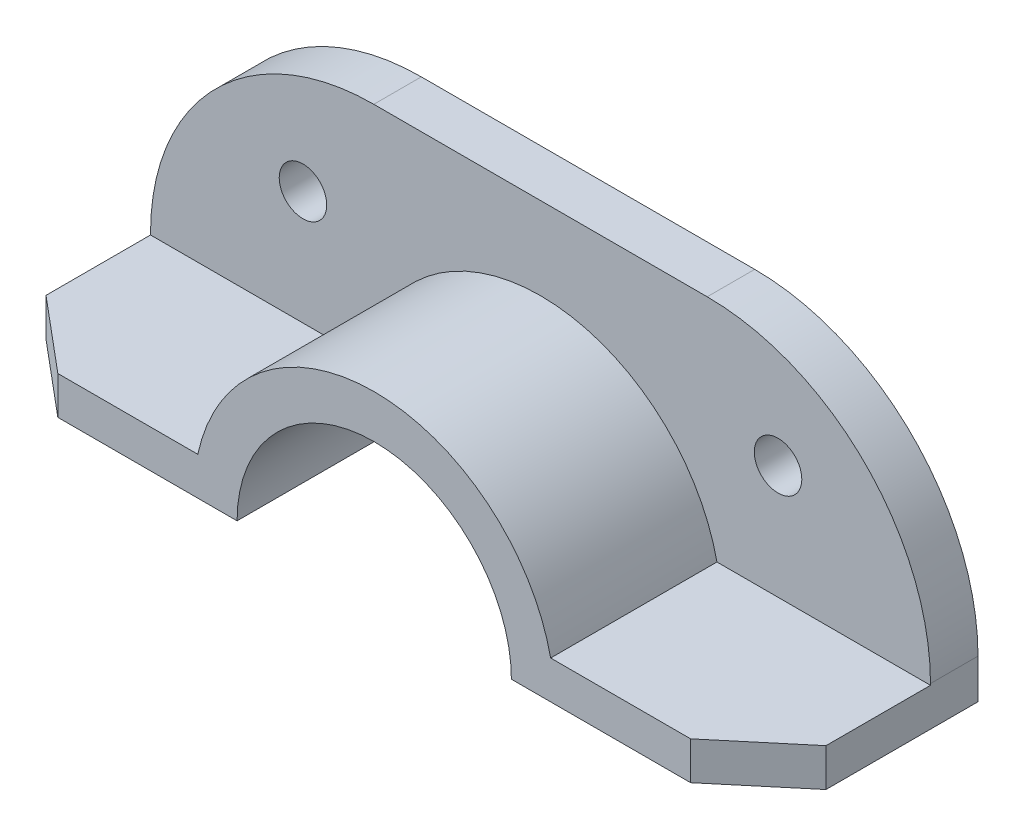
ISO-10303-21;
HEADER;
FILE_DESCRIPTION(('STEP AP214'),'2;1');
FILE_NAME('part.step','',(''),(''),'','','');
FILE_SCHEMA(('AUTOMOTIVE_DESIGN { 1 0 10303 214 1 1 1 1 }'));
ENDSEC;
DATA;
#1=APPLICATION_CONTEXT('core data for automotive mechanical design processes');
#2=APPLICATION_PROTOCOL_DEFINITION('international standard','automotive_design',2000,#1);
#3=PRODUCT_CONTEXT('',#1,'mechanical');
#4=PRODUCT('Part','Part','',(#3));
#5=PRODUCT_RELATED_PRODUCT_CATEGORY('part','',(#4));
#6=PRODUCT_DEFINITION_FORMATION('','',#4);
#7=PRODUCT_DEFINITION_CONTEXT('part definition',#1,'design');
#8=PRODUCT_DEFINITION('design','',#6,#7);
#9=PRODUCT_DEFINITION_SHAPE('','',#8);
#10=(LENGTH_UNIT() NAMED_UNIT(*) SI_UNIT(.MILLI.,.METRE.));
#11=(NAMED_UNIT(*) PLANE_ANGLE_UNIT() SI_UNIT($,.RADIAN.));
#12=(NAMED_UNIT(*) SI_UNIT($,.STERADIAN.) SOLID_ANGLE_UNIT());
#13=UNCERTAINTY_MEASURE_WITH_UNIT(LENGTH_MEASURE(1.E-05),#10,'distance_accuracy_value','');
#14=(GEOMETRIC_REPRESENTATION_CONTEXT(3) GLOBAL_UNCERTAINTY_ASSIGNED_CONTEXT((#13)) GLOBAL_UNIT_ASSIGNED_CONTEXT((#10,
#11,#12)) REPRESENTATION_CONTEXT('',''));
#15=CARTESIAN_POINT('',(0.,0.,0.));
#16=DIRECTION('',(0.,0.,1.));
#17=DIRECTION('',(1.,0.,0.));
#18=AXIS2_PLACEMENT_3D('',#15,#16,#17);
#19=CARTESIAN_POINT('',(-82.0881817576966,8.,20.));
#20=DIRECTION('',(0.,1.,0.));
#21=DIRECTION('',(-1.,0.,0.));
#22=AXIS2_PLACEMENT_3D('',#19,#20,#21);
#23=PLANE('',#22);
#24=DIRECTION('',(0.,0.,-1.));
#25=VECTOR('',#24,1.);
#26=CARTESIAN_POINT('',(-82.0881817576966,8.,20.));
#27=LINE('',#26,#25);
#28=CARTESIAN_POINT('',(-82.0881817576966,8.,7.));
#29=VERTEX_POINT('',#28);
#30=CARTESIAN_POINT('',(-82.0881817576966,8.,-15.));
#31=VERTEX_POINT('',#30);
#32=EDGE_CURVE('E152',#29,#31,#27,.T.);
#33=ORIENTED_EDGE('',*,*,#32,.F.);
#34=DIRECTION('',(0.766044443118982,0.,0.642787609686535));
#35=VECTOR('',#34,1.);
#36=CARTESIAN_POINT('',(-66.5953850539717,8.,20.));
#37=LINE('',#36,#35);
#38=CARTESIAN_POINT('',(-66.5953850539717,8.,20.));
#39=VERTEX_POINT('',#38);
#40=EDGE_CURVE('E140',#29,#39,#37,.T.);
#41=ORIENTED_EDGE('',*,*,#40,.T.);
#42=DIRECTION('',(1.,0.,0.));
#43=VECTOR('',#42,1.);
#44=CARTESIAN_POINT('',(-82.0881817576966,8.,20.));
#45=LINE('',#44,#43);
#46=CARTESIAN_POINT('',(-37.1346503952674,7.99999999999999,20.));
#47=VERTEX_POINT('',#46);
#48=EDGE_CURVE('E149',#39,#47,#45,.T.);
#49=ORIENTED_EDGE('',*,*,#48,.T.);
#50=DIRECTION('',(0.,0.,-1.));
#51=VECTOR('',#50,1.);
#52=CARTESIAN_POINT('',(-37.1346503952674,7.99999999999999,20.));
#53=LINE('',#52,#51);
#54=CARTESIAN_POINT('',(-37.1346503952674,7.99999999999999,-15.));
#55=VERTEX_POINT('',#54);
#56=EDGE_CURVE('E172',#47,#55,#53,.T.);
#57=ORIENTED_EDGE('',*,*,#56,.T.);
#58=DIRECTION('',(-1.,0.,0.));
#59=VECTOR('',#58,1.);
#60=CARTESIAN_POINT('',(-82.0881817576966,8.,-15.));
#61=LINE('',#60,#59);
#62=EDGE_CURVE('E159',#55,#31,#61,.T.);
#63=ORIENTED_EDGE('',*,*,#62,.T.);
#64=EDGE_LOOP('',(#33,#41,#49,#57,#63));
#65=FACE_BOUND('',#64,.T.);
#66=ADVANCED_FACE('F37',(#65),#23,.T.);
#67=CARTESIAN_POINT('',(0.,0.,20.));
#68=DIRECTION('',(0.,0.,1.));
#69=DIRECTION('',(1.,0.,0.));
#70=AXIS2_PLACEMENT_3D('',#67,#68,#69);
#71=PLANE('',#70);
#72=ORIENTED_EDGE('',*,*,#48,.F.);
#73=DIRECTION('',(0.,1.,0.));
#74=VECTOR('',#73,1.);
#75=CARTESIAN_POINT('',(-66.5953850539717,-2.,20.));
#76=LINE('',#75,#74);
#77=CARTESIAN_POINT('',(-66.5953850539717,0.,20.));
#78=VERTEX_POINT('',#77);
#79=EDGE_CURVE('E137',#78,#39,#76,.T.);
#80=ORIENTED_EDGE('',*,*,#79,.F.);
#81=DIRECTION('',(-1.,0.,0.));
#82=VECTOR('',#81,1.);
#83=CARTESIAN_POINT('',(-28.8690728974509,0.,20.));
#84=LINE('',#83,#82);
#85=CARTESIAN_POINT('',(-28.8690728974509,0.,20.));
#86=VERTEX_POINT('',#85);
#87=EDGE_CURVE('E158',#86,#78,#84,.T.);
#88=ORIENTED_EDGE('',*,*,#87,.F.);
#89=CARTESIAN_POINT('',(0.,0.,20.));
#90=DIRECTION('',(0.,0.,-1.));
#91=DIRECTION('',(1.,0.,0.));
#92=AXIS2_PLACEMENT_3D('',#89,#90,#91);
#93=CIRCLE('',#92,28.8690728974509);
#94=CARTESIAN_POINT('',(28.8690728974509,0.,20.));
#95=VERTEX_POINT('',#94);
#96=EDGE_CURVE('E207',#86,#95,#93,.T.);
#97=ORIENTED_EDGE('',*,*,#96,.T.);
#98=DIRECTION('',(1.,0.,0.));
#99=VECTOR('',#98,1.);
#100=CARTESIAN_POINT('',(28.8690728974509,0.,20.));
#101=LINE('',#100,#99);
#102=CARTESIAN_POINT('',(66.5953850539717,0.,20.));
#103=VERTEX_POINT('',#102);
#104=EDGE_CURVE('E210',#95,#103,#101,.T.);
#105=ORIENTED_EDGE('',*,*,#104,.T.);
#106=DIRECTION('',(0.,-1.,0.));
#107=VECTOR('',#106,1.);
#108=CARTESIAN_POINT('',(66.5953850539717,0.,20.));
#109=LINE('',#108,#107);
#110=CARTESIAN_POINT('',(66.5953850539717,8.,20.));
#111=VERTEX_POINT('',#110);
#112=EDGE_CURVE('E236',#111,#103,#109,.T.);
#113=ORIENTED_EDGE('',*,*,#112,.F.);
#114=DIRECTION('',(-1.,0.,0.));
#115=VECTOR('',#114,1.);
#116=CARTESIAN_POINT('',(82.0881817576966,8.,20.));
#117=LINE('',#116,#115);
#118=CARTESIAN_POINT('',(37.1346503952674,7.99999999999999,20.));
#119=VERTEX_POINT('',#118);
#120=EDGE_CURVE('E213',#111,#119,#117,.T.);
#121=ORIENTED_EDGE('',*,*,#120,.T.);
#122=CARTESIAN_POINT('',(0.,0.,20.));
#123=DIRECTION('',(0.,0.,1.));
#124=DIRECTION('',(1.,0.,0.));
#125=AXIS2_PLACEMENT_3D('',#122,#123,#124);
#126=CIRCLE('',#125,37.9866063235285);
#127=EDGE_CURVE('E156',#119,#47,#126,.T.);
#128=ORIENTED_EDGE('',*,*,#127,.T.);
#129=EDGE_LOOP('',(#72,#80,#88,#97,#105,#113,#121,#128));
#130=FACE_BOUND('',#129,.T.);
#131=ADVANCED_FACE('F154',(#130),#71,.T.);
#132=CARTESIAN_POINT('',(-82.0881817576966,0.,20.));
#133=DIRECTION('',(-1.,0.,0.));
#134=DIRECTION('',(0.,0.,1.));
#135=AXIS2_PLACEMENT_3D('',#132,#133,#134);
#136=PLANE('',#135);
#137=DIRECTION('',(0.,0.,-1.));
#138=VECTOR('',#137,1.);
#139=CARTESIAN_POINT('',(-82.0881817576966,0.,20.));
#140=LINE('',#139,#138);
#141=CARTESIAN_POINT('',(-82.0881817576966,0.,6.99999999999999));
#142=VERTEX_POINT('',#141);
#143=CARTESIAN_POINT('',(-82.0881817576966,0.,-25.));
#144=VERTEX_POINT('',#143);
#145=EDGE_CURVE('E169',#142,#144,#140,.T.);
#146=ORIENTED_EDGE('',*,*,#145,.F.);
#147=DIRECTION('',(0.,1.,0.));
#148=VECTOR('',#147,1.);
#149=CARTESIAN_POINT('',(-82.0881817576966,-2.,7.));
#150=LINE('',#149,#148);
#151=EDGE_CURVE('E52',#142,#29,#150,.T.);
#152=ORIENTED_EDGE('',*,*,#151,.T.);
#153=ORIENTED_EDGE('',*,*,#32,.T.);
#154=DIRECTION('',(0.,-1.,0.));
#155=VECTOR('',#154,1.);
#156=CARTESIAN_POINT('',(-82.0881817576966,0.,-15.));
#157=LINE('',#156,#155);
#158=CARTESIAN_POINT('',(-82.0881817576966,8.32638444481943,-15.));
#159=VERTEX_POINT('',#158);
#160=EDGE_CURVE('E259',#159,#31,#157,.T.);
#161=ORIENTED_EDGE('',*,*,#160,.F.);
#162=DIRECTION('',(0.,0.,1.));
#163=VECTOR('',#162,1.);
#164=CARTESIAN_POINT('',(-82.0881817576966,8.32638444481944,-25.));
#165=LINE('',#164,#163);
#166=CARTESIAN_POINT('',(-82.0881817576966,8.32638444481943,-25.));
#167=VERTEX_POINT('',#166);
#168=EDGE_CURVE('E59',#159,#167,#165,.F.);
#169=ORIENTED_EDGE('',*,*,#168,.T.);
#170=DIRECTION('',(0.,-1.,0.));
#171=VECTOR('',#170,1.);
#172=CARTESIAN_POINT('',(-82.0881817576966,0.,-25.));
#173=LINE('',#172,#171);
#174=EDGE_CURVE('E163',#167,#144,#173,.T.);
#175=ORIENTED_EDGE('',*,*,#174,.T.);
#176=EDGE_LOOP('',(#146,#152,#153,#161,#169,#175));
#177=FACE_BOUND('',#176,.T.);
#178=ADVANCED_FACE('F261',(#177),#136,.T.);
#179=CARTESIAN_POINT('',(-28.8690728974509,0.,20.));
#180=DIRECTION('',(0.,-1.,0.));
#181=DIRECTION('',(0.,0.,-1.));
#182=AXIS2_PLACEMENT_3D('',#179,#180,#181);
#183=PLANE('',#182);
#184=ORIENTED_EDGE('',*,*,#87,.T.);
#185=DIRECTION('',(-0.766044443118982,0.,-0.642787609686535));
#186=VECTOR('',#185,1.);
#187=CARTESIAN_POINT('',(-44.4566762976743,0.,38.5765823521501));
#188=LINE('',#187,#186);
#189=EDGE_CURVE('E11',#78,#142,#188,.T.);
#190=ORIENTED_EDGE('',*,*,#189,.T.);
#191=ORIENTED_EDGE('',*,*,#145,.T.);
#192=DIRECTION('',(1.,0.,0.));
#193=VECTOR('',#192,1.);
#194=CARTESIAN_POINT('',(-28.8690728974509,0.,-25.));
#195=LINE('',#194,#193);
#196=CARTESIAN_POINT('',(-28.8690728974509,0.,-25.));
#197=VERTEX_POINT('',#196);
#198=EDGE_CURVE('E262',#144,#197,#195,.T.);
#199=ORIENTED_EDGE('',*,*,#198,.T.);
#200=DIRECTION('',(0.,0.,-1.));
#201=VECTOR('',#200,1.);
#202=CARTESIAN_POINT('',(-28.8690728974509,0.,20.));
#203=LINE('',#202,#201);
#204=EDGE_CURVE('E161',#86,#197,#203,.T.);
#205=ORIENTED_EDGE('',*,*,#204,.F.);
#206=EDGE_LOOP('',(#184,#190,#191,#199,#205));
#207=FACE_BOUND('',#206,.T.);
#208=ADVANCED_FACE('F274',(#207),#183,.T.);
#209=CARTESIAN_POINT('',(0.,0.,20.));
#210=DIRECTION('',(0.,0.,-1.));
#211=DIRECTION('',(-1.,0.,0.));
#212=AXIS2_PLACEMENT_3D('',#209,#210,#211);
#213=CYLINDRICAL_SURFACE('',#212,37.9866063235285);
#214=CARTESIAN_POINT('',(0.,0.,-15.));
#215=DIRECTION('',(0.,0.,-1.));
#216=DIRECTION('',(-1.,0.,0.));
#217=AXIS2_PLACEMENT_3D('',#214,#215,#216);
#218=CIRCLE('',#217,37.9866063235285);
#219=CARTESIAN_POINT('',(37.1346503952674,7.99999999999999,-15.));
#220=VERTEX_POINT('',#219);
#221=EDGE_CURVE('E199',#55,#220,#218,.T.);
#222=ORIENTED_EDGE('',*,*,#221,.F.);
#223=ORIENTED_EDGE('',*,*,#56,.F.);
#224=ORIENTED_EDGE('',*,*,#127,.F.);
#225=DIRECTION('',(0.,0.,-1.));
#226=VECTOR('',#225,1.);
#227=CARTESIAN_POINT('',(37.1346503952674,7.99999999999999,20.));
#228=LINE('',#227,#226);
#229=EDGE_CURVE('E216',#119,#220,#228,.T.);
#230=ORIENTED_EDGE('',*,*,#229,.T.);
#231=EDGE_LOOP('',(#222,#223,#224,#230));
#232=FACE_BOUND('',#231,.T.);
#233=ADVANCED_FACE('F303',(#232),#213,.T.);
#234=CARTESIAN_POINT('',(82.0881817576966,8.,20.));
#235=DIRECTION('',(0.,-1.,0.));
#236=DIRECTION('',(1.,0.,0.));
#237=AXIS2_PLACEMENT_3D('',#234,#235,#236);
#238=PLANE('',#237);
#239=ORIENTED_EDGE('',*,*,#120,.F.);
#240=DIRECTION('',(-0.766044443118982,0.,0.642787609686535));
#241=VECTOR('',#240,1.);
#242=CARTESIAN_POINT('',(66.5953850539717,8.,20.));
#243=LINE('',#242,#241);
#244=CARTESIAN_POINT('',(82.0881817576966,8.,7.));
#245=VERTEX_POINT('',#244);
#246=EDGE_CURVE('E174',#245,#111,#243,.T.);
#247=ORIENTED_EDGE('',*,*,#246,.F.);
#248=DIRECTION('',(0.,0.,-1.));
#249=VECTOR('',#248,1.);
#250=CARTESIAN_POINT('',(82.0881817576966,8.,20.));
#251=LINE('',#250,#249);
#252=CARTESIAN_POINT('',(82.0881817576966,7.99999999999999,-15.));
#253=VERTEX_POINT('',#252);
#254=EDGE_CURVE('E219',#245,#253,#251,.T.);
#255=ORIENTED_EDGE('',*,*,#254,.T.);
#256=DIRECTION('',(1.,0.,0.));
#257=VECTOR('',#256,1.);
#258=CARTESIAN_POINT('',(82.0881817576966,8.,-15.));
#259=LINE('',#258,#257);
#260=EDGE_CURVE('E204',#220,#253,#259,.T.);
#261=ORIENTED_EDGE('',*,*,#260,.F.);
#262=ORIENTED_EDGE('',*,*,#229,.F.);
#263=EDGE_LOOP('',(#239,#247,#255,#261,#262));
#264=FACE_BOUND('',#263,.T.);
#265=ADVANCED_FACE('F298',(#264),#238,.F.);
#266=CARTESIAN_POINT('',(0.,0.,20.));
#267=DIRECTION('',(0.,0.,-1.));
#268=DIRECTION('',(-1.,0.,0.));
#269=AXIS2_PLACEMENT_3D('',#266,#267,#268);
#270=CYLINDRICAL_SURFACE('',#269,28.8690728974509);
#271=ORIENTED_EDGE('',*,*,#204,.T.);
#272=CARTESIAN_POINT('',(0.,0.,-25.));
#273=DIRECTION('',(0.,0.,1.));
#274=DIRECTION('',(-1.,0.,0.));
#275=AXIS2_PLACEMENT_3D('',#272,#273,#274);
#276=CIRCLE('',#275,28.8690728974509);
#277=CARTESIAN_POINT('',(28.8690728974509,0.,-25.));
#278=VERTEX_POINT('',#277);
#279=EDGE_CURVE('E188',#278,#197,#276,.T.);
#280=ORIENTED_EDGE('',*,*,#279,.F.);
#281=DIRECTION('',(0.,0.,-1.));
#282=VECTOR('',#281,1.);
#283=CARTESIAN_POINT('',(28.8690728974509,0.,20.));
#284=LINE('',#283,#282);
#285=EDGE_CURVE('E223',#95,#278,#284,.T.);
#286=ORIENTED_EDGE('',*,*,#285,.F.);
#287=ORIENTED_EDGE('',*,*,#96,.F.);
#288=EDGE_LOOP('',(#271,#280,#286,#287));
#289=FACE_BOUND('',#288,.T.);
#290=ADVANCED_FACE('F280',(#289),#270,.F.);
#291=CARTESIAN_POINT('',(28.8690728974509,0.,20.));
#292=DIRECTION('',(0.,1.,0.));
#293=DIRECTION('',(0.,0.,1.));
#294=AXIS2_PLACEMENT_3D('',#291,#292,#293);
#295=PLANE('',#294);
#296=DIRECTION('',(0.,0.,-1.));
#297=VECTOR('',#296,1.);
#298=CARTESIAN_POINT('',(82.0881817576966,0.,20.));
#299=LINE('',#298,#297);
#300=CARTESIAN_POINT('',(82.0881817576966,0.,7.));
#301=VERTEX_POINT('',#300);
#302=CARTESIAN_POINT('',(82.0881817576966,0.,-25.));
#303=VERTEX_POINT('',#302);
#304=EDGE_CURVE('E221',#301,#303,#299,.T.);
#305=ORIENTED_EDGE('',*,*,#304,.F.);
#306=DIRECTION('',(-0.766044443118982,0.,0.642787609686535));
#307=VECTOR('',#306,1.);
#308=CARTESIAN_POINT('',(44.4566762976743,0.,38.5765823521501));
#309=LINE('',#308,#307);
#310=EDGE_CURVE('E178',#301,#103,#309,.T.);
#311=ORIENTED_EDGE('',*,*,#310,.T.);
#312=ORIENTED_EDGE('',*,*,#104,.F.);
#313=ORIENTED_EDGE('',*,*,#285,.T.);
#314=DIRECTION('',(-1.,0.,0.));
#315=VECTOR('',#314,1.);
#316=CARTESIAN_POINT('',(28.8690728974509,0.,-25.));
#317=LINE('',#316,#315);
#318=EDGE_CURVE('E196',#303,#278,#317,.T.);
#319=ORIENTED_EDGE('',*,*,#318,.F.);
#320=EDGE_LOOP('',(#305,#311,#312,#313,#319));
#321=FACE_BOUND('',#320,.T.);
#322=ADVANCED_FACE('F284',(#321),#295,.F.);
#323=CARTESIAN_POINT('',(82.0881817576966,0.,20.));
#324=DIRECTION('',(-1.,0.,0.));
#325=DIRECTION('',(0.,0.,1.));
#326=AXIS2_PLACEMENT_3D('',#323,#324,#325);
#327=PLANE('',#326);
#328=ORIENTED_EDGE('',*,*,#254,.F.);
#329=DIRECTION('',(0.,1.,0.));
#330=VECTOR('',#329,1.);
#331=CARTESIAN_POINT('',(82.0881817576966,-2.,7.));
#332=LINE('',#331,#330);
#333=EDGE_CURVE('E176',#301,#245,#332,.T.);
#334=ORIENTED_EDGE('',*,*,#333,.F.);
#335=ORIENTED_EDGE('',*,*,#304,.T.);
#336=DIRECTION('',(0.,-1.,0.));
#337=VECTOR('',#336,1.);
#338=CARTESIAN_POINT('',(82.0881817576966,0.,-25.));
#339=LINE('',#338,#337);
#340=CARTESIAN_POINT('',(82.0881817576966,8.32638444481943,-25.));
#341=VERTEX_POINT('',#340);
#342=EDGE_CURVE('E193',#341,#303,#339,.T.);
#343=ORIENTED_EDGE('',*,*,#342,.F.);
#344=DIRECTION('',(0.,0.,1.));
#345=VECTOR('',#344,1.);
#346=CARTESIAN_POINT('',(82.0881817576966,8.32638444481944,20.));
#347=LINE('',#346,#345);
#348=CARTESIAN_POINT('',(82.0881817576966,8.32638444481943,-15.));
#349=VERTEX_POINT('',#348);
#350=EDGE_CURVE('E225',#341,#349,#347,.T.);
#351=ORIENTED_EDGE('',*,*,#350,.T.);
#352=DIRECTION('',(0.,-1.,0.));
#353=VECTOR('',#352,1.);
#354=CARTESIAN_POINT('',(82.0881817576966,0.,-15.));
#355=LINE('',#354,#353);
#356=EDGE_CURVE('E191',#349,#253,#355,.T.);
#357=ORIENTED_EDGE('',*,*,#356,.T.);
#358=EDGE_LOOP('',(#328,#334,#335,#343,#351,#357));
#359=FACE_BOUND('',#358,.T.);
#360=ADVANCED_FACE('F289',(#359),#327,.F.);
#361=CARTESIAN_POINT('',(0.,0.,-15.));
#362=DIRECTION('',(0.,0.,-1.));
#363=DIRECTION('',(-1.,0.,0.));
#364=AXIS2_PLACEMENT_3D('',#361,#362,#363);
#365=PLANE('',#364);
#366=CARTESIAN_POINT('',(-50.,32.,-15.));
#367=DIRECTION('',(0.,0.,-1.));
#368=DIRECTION('',(-1.,0.,0.));
#369=AXIS2_PLACEMENT_3D('',#366,#367,#368);
#370=CIRCLE('',#369,5.);
#371=CARTESIAN_POINT('',(-55.,32.,-15.));
#372=VERTEX_POINT('',#371);
#373=EDGE_CURVE('E267',#372,#372,#370,.T.);
#374=ORIENTED_EDGE('',*,*,#373,.T.);
#375=EDGE_LOOP('',(#374));
#376=FACE_BOUND('',#375,.T.);
#377=CARTESIAN_POINT('',(50.,32.,-15.));
#378=DIRECTION('',(0.,0.,1.));
#379=DIRECTION('',(1.,0.,0.));
#380=AXIS2_PLACEMENT_3D('',#377,#378,#379);
#381=CIRCLE('',#380,5.);
#382=CARTESIAN_POINT('',(55.,32.,-15.));
#383=VERTEX_POINT('',#382);
#384=EDGE_CURVE('E181',#383,#383,#381,.T.);
#385=ORIENTED_EDGE('',*,*,#384,.F.);
#386=EDGE_LOOP('',(#385));
#387=FACE_BOUND('',#386,.T.);
#388=DIRECTION('',(1.,0.,0.));
#389=VECTOR('',#388,1.);
#390=CARTESIAN_POINT('',(82.0881817576966,55.3263844448194,-15.));
#391=LINE('',#390,#389);
#392=CARTESIAN_POINT('',(-35.0881817576966,55.3263844448194,-15.));
#393=VERTEX_POINT('',#392);
#394=CARTESIAN_POINT('',(35.0881817576966,55.3263844448194,-15.));
#395=VERTEX_POINT('',#394);
#396=EDGE_CURVE('E185',#393,#395,#391,.T.);
#397=ORIENTED_EDGE('',*,*,#396,.F.);
#398=CARTESIAN_POINT('',(-35.0881817576966,8.32638444481944,-15.));
#399=DIRECTION('',(0.,0.,-1.));
#400=DIRECTION('',(-1.,0.,0.));
#401=AXIS2_PLACEMENT_3D('',#398,#399,#400);
#402=CIRCLE('',#401,47.);
#403=EDGE_CURVE('E241',#393,#159,#402,.F.);
#404=ORIENTED_EDGE('',*,*,#403,.T.);
#405=ORIENTED_EDGE('',*,*,#160,.T.);
#406=ORIENTED_EDGE('',*,*,#62,.F.);
#407=ORIENTED_EDGE('',*,*,#221,.T.);
#408=ORIENTED_EDGE('',*,*,#260,.T.);
#409=ORIENTED_EDGE('',*,*,#356,.F.);
#410=CARTESIAN_POINT('',(35.0881817576966,8.32638444481944,-15.));
#411=DIRECTION('',(0.,0.,-1.));
#412=DIRECTION('',(-1.,0.,0.));
#413=AXIS2_PLACEMENT_3D('',#410,#411,#412);
#414=CIRCLE('',#413,47.);
#415=EDGE_CURVE('E228',#349,#395,#414,.F.);
#416=ORIENTED_EDGE('',*,*,#415,.T.);
#417=EDGE_LOOP('',(#397,#404,#405,#406,#407,#408,#409,#416));
#418=FACE_BOUND('',#417,.T.);
#419=ADVANCED_FACE('F257',(#376,#387,#418),#365,.F.);
#420=CARTESIAN_POINT('',(82.0881817576966,55.3263844448194,-25.));
#421=DIRECTION('',(0.,-1.,0.));
#422=DIRECTION('',(0.,0.,-1.));
#423=AXIS2_PLACEMENT_3D('',#420,#421,#422);
#424=PLANE('',#423);
#425=DIRECTION('',(1.,0.,0.));
#426=VECTOR('',#425,1.);
#427=CARTESIAN_POINT('',(82.0881817576966,55.3263844448194,-25.));
#428=LINE('',#427,#426);
#429=CARTESIAN_POINT('',(-35.0881817576966,55.3263844448194,-25.));
#430=VERTEX_POINT('',#429);
#431=CARTESIAN_POINT('',(35.0881817576966,55.3263844448194,-25.));
#432=VERTEX_POINT('',#431);
#433=EDGE_CURVE('E190',#430,#432,#428,.T.);
#434=ORIENTED_EDGE('',*,*,#433,.F.);
#435=DIRECTION('',(0.,0.,1.));
#436=VECTOR('',#435,1.);
#437=CARTESIAN_POINT('',(-35.0881817576966,55.3263844448194,-15.));
#438=LINE('',#437,#436);
#439=EDGE_CURVE('E238',#430,#393,#438,.T.);
#440=ORIENTED_EDGE('',*,*,#439,.T.);
#441=ORIENTED_EDGE('',*,*,#396,.T.);
#442=DIRECTION('',(0.,0.,1.));
#443=VECTOR('',#442,1.);
#444=CARTESIAN_POINT('',(35.0881817576966,55.3263844448194,-25.));
#445=LINE('',#444,#443);
#446=EDGE_CURVE('E231',#395,#432,#445,.F.);
#447=ORIENTED_EDGE('',*,*,#446,.T.);
#448=EDGE_LOOP('',(#434,#440,#441,#447));
#449=FACE_BOUND('',#448,.T.);
#450=ADVANCED_FACE('F251',(#449),#424,.F.);
#451=CARTESIAN_POINT('',(0.,0.,-25.));
#452=DIRECTION('',(0.,0.,-1.));
#453=DIRECTION('',(-1.,0.,0.));
#454=AXIS2_PLACEMENT_3D('',#451,#452,#453);
#455=PLANE('',#454);
#456=CARTESIAN_POINT('',(-50.,32.,-25.));
#457=DIRECTION('',(0.,0.,-1.));
#458=DIRECTION('',(-1.,0.,0.));
#459=AXIS2_PLACEMENT_3D('',#456,#457,#458);
#460=CIRCLE('',#459,5.);
#461=CARTESIAN_POINT('',(-55.,32.,-25.));
#462=VERTEX_POINT('',#461);
#463=EDGE_CURVE('E263',#462,#462,#460,.T.);
#464=ORIENTED_EDGE('',*,*,#463,.F.);
#465=EDGE_LOOP('',(#464));
#466=FACE_BOUND('',#465,.T.);
#467=CARTESIAN_POINT('',(50.,32.,-25.));
#468=DIRECTION('',(0.,0.,1.));
#469=DIRECTION('',(1.,0.,0.));
#470=AXIS2_PLACEMENT_3D('',#467,#468,#469);
#471=CIRCLE('',#470,5.);
#472=CARTESIAN_POINT('',(55.,32.,-25.));
#473=VERTEX_POINT('',#472);
#474=EDGE_CURVE('E182',#473,#473,#471,.T.);
#475=ORIENTED_EDGE('',*,*,#474,.T.);
#476=EDGE_LOOP('',(#475));
#477=FACE_BOUND('',#476,.T.);
#478=ORIENTED_EDGE('',*,*,#174,.F.);
#479=CARTESIAN_POINT('',(-35.0881817576966,8.32638444481944,-25.));
#480=DIRECTION('',(0.,0.,-1.));
#481=DIRECTION('',(-1.,0.,0.));
#482=AXIS2_PLACEMENT_3D('',#479,#480,#481);
#483=CIRCLE('',#482,47.);
#484=EDGE_CURVE('E45',#167,#430,#483,.T.);
#485=ORIENTED_EDGE('',*,*,#484,.T.);
#486=ORIENTED_EDGE('',*,*,#433,.T.);
#487=CARTESIAN_POINT('',(35.0881817576966,8.32638444481944,-25.));
#488=DIRECTION('',(0.,0.,-1.));
#489=DIRECTION('',(-1.,0.,0.));
#490=AXIS2_PLACEMENT_3D('',#487,#488,#489);
#491=CIRCLE('',#490,47.);
#492=EDGE_CURVE('E234',#432,#341,#491,.T.);
#493=ORIENTED_EDGE('',*,*,#492,.T.);
#494=ORIENTED_EDGE('',*,*,#342,.T.);
#495=ORIENTED_EDGE('',*,*,#318,.T.);
#496=ORIENTED_EDGE('',*,*,#279,.T.);
#497=ORIENTED_EDGE('',*,*,#198,.F.);
#498=EDGE_LOOP('',(#478,#485,#486,#493,#494,#495,#496,#497));
#499=FACE_BOUND('',#498,.T.);
#500=ADVANCED_FACE('F246',(#466,#477,#499),#455,.T.);
#501=CARTESIAN_POINT('',(35.0881817576966,8.32638444481944,20.));
#502=DIRECTION('',(0.,0.,1.));
#503=DIRECTION('',(1.,0.,0.));
#504=AXIS2_PLACEMENT_3D('',#501,#502,#503);
#505=CYLINDRICAL_SURFACE('',#504,47.);
#506=ORIENTED_EDGE('',*,*,#492,.F.);
#507=ORIENTED_EDGE('',*,*,#446,.F.);
#508=ORIENTED_EDGE('',*,*,#415,.F.);
#509=ORIENTED_EDGE('',*,*,#350,.F.);
#510=EDGE_LOOP('',(#506,#507,#508,#509));
#511=FACE_BOUND('',#510,.T.);
#512=ADVANCED_FACE('F293',(#511),#505,.T.);
#513=CARTESIAN_POINT('',(50.,32.,-25.));
#514=DIRECTION('',(0.,0.,1.));
#515=DIRECTION('',(1.,0.,0.));
#516=AXIS2_PLACEMENT_3D('',#513,#514,#515);
#517=CYLINDRICAL_SURFACE('',#516,5.);
#518=ORIENTED_EDGE('',*,*,#474,.F.);
#519=EDGE_LOOP('',(#518));
#520=FACE_BOUND('',#519,.T.);
#521=ORIENTED_EDGE('',*,*,#384,.T.);
#522=EDGE_LOOP('',(#521));
#523=FACE_BOUND('',#522,.T.);
#524=ADVANCED_FACE('F323',(#520,#523),#517,.F.);
#525=CARTESIAN_POINT('',(66.5953850539717,-2.,20.));
#526=DIRECTION('',(-0.642787609686535,0.,-0.766044443118982));
#527=DIRECTION('',(-0.766044443118982,0.,0.642787609686535));
#528=AXIS2_PLACEMENT_3D('',#525,#526,#527);
#529=PLANE('',#528);
#530=ORIENTED_EDGE('',*,*,#333,.T.);
#531=ORIENTED_EDGE('',*,*,#246,.T.);
#532=ORIENTED_EDGE('',*,*,#112,.T.);
#533=ORIENTED_EDGE('',*,*,#310,.F.);
#534=EDGE_LOOP('',(#530,#531,#532,#533));
#535=FACE_BOUND('',#534,.T.);
#536=ADVANCED_FACE('F301',(#535),#529,.F.);
#537=CARTESIAN_POINT('',(-35.0881817576966,8.32638444481944,-25.));
#538=DIRECTION('',(0.,0.,-1.));
#539=DIRECTION('',(-1.,0.,0.));
#540=AXIS2_PLACEMENT_3D('',#537,#538,#539);
#541=CYLINDRICAL_SURFACE('',#540,47.);
#542=ORIENTED_EDGE('',*,*,#484,.F.);
#543=ORIENTED_EDGE('',*,*,#168,.F.);
#544=ORIENTED_EDGE('',*,*,#403,.F.);
#545=ORIENTED_EDGE('',*,*,#439,.F.);
#546=EDGE_LOOP('',(#542,#543,#544,#545));
#547=FACE_BOUND('',#546,.T.);
#548=ADVANCED_FACE('F39',(#547),#541,.T.);
#549=CARTESIAN_POINT('',(-50.,32.,-25.));
#550=DIRECTION('',(0.,0.,1.));
#551=DIRECTION('',(1.,0.,0.));
#552=AXIS2_PLACEMENT_3D('',#549,#550,#551);
#553=CYLINDRICAL_SURFACE('',#552,5.);
#554=ORIENTED_EDGE('',*,*,#463,.T.);
#555=EDGE_LOOP('',(#554));
#556=FACE_BOUND('',#555,.T.);
#557=ORIENTED_EDGE('',*,*,#373,.F.);
#558=EDGE_LOOP('',(#557));
#559=FACE_BOUND('',#558,.T.);
#560=ADVANCED_FACE('F348',(#556,#559),#553,.F.);
#561=CARTESIAN_POINT('',(-66.5953850539717,-2.,20.));
#562=DIRECTION('',(-0.642787609686535,0.,0.766044443118982));
#563=DIRECTION('',(0.766044443118982,0.,0.642787609686535));
#564=AXIS2_PLACEMENT_3D('',#561,#562,#563);
#565=PLANE('',#564);
#566=ORIENTED_EDGE('',*,*,#79,.T.);
#567=ORIENTED_EDGE('',*,*,#40,.F.);
#568=ORIENTED_EDGE('',*,*,#151,.F.);
#569=ORIENTED_EDGE('',*,*,#189,.F.);
#570=EDGE_LOOP('',(#566,#567,#568,#569));
#571=FACE_BOUND('',#570,.T.);
#572=ADVANCED_FACE('F139',(#571),#565,.T.);
#573=CLOSED_SHELL('',(#66,#131,#178,#208,#233,#265,#290,#322,#360,#419,#450,#500,#512,#524,#536,
#548,#560,#572));
#574=MANIFOLD_SOLID_BREP('B2',#573);
#575=ADVANCED_BREP_SHAPE_REPRESENTATION('',(#18,#574),#14);
#576=SHAPE_DEFINITION_REPRESENTATION(#9,#575);
ENDSEC;
END-ISO-10303-21;
